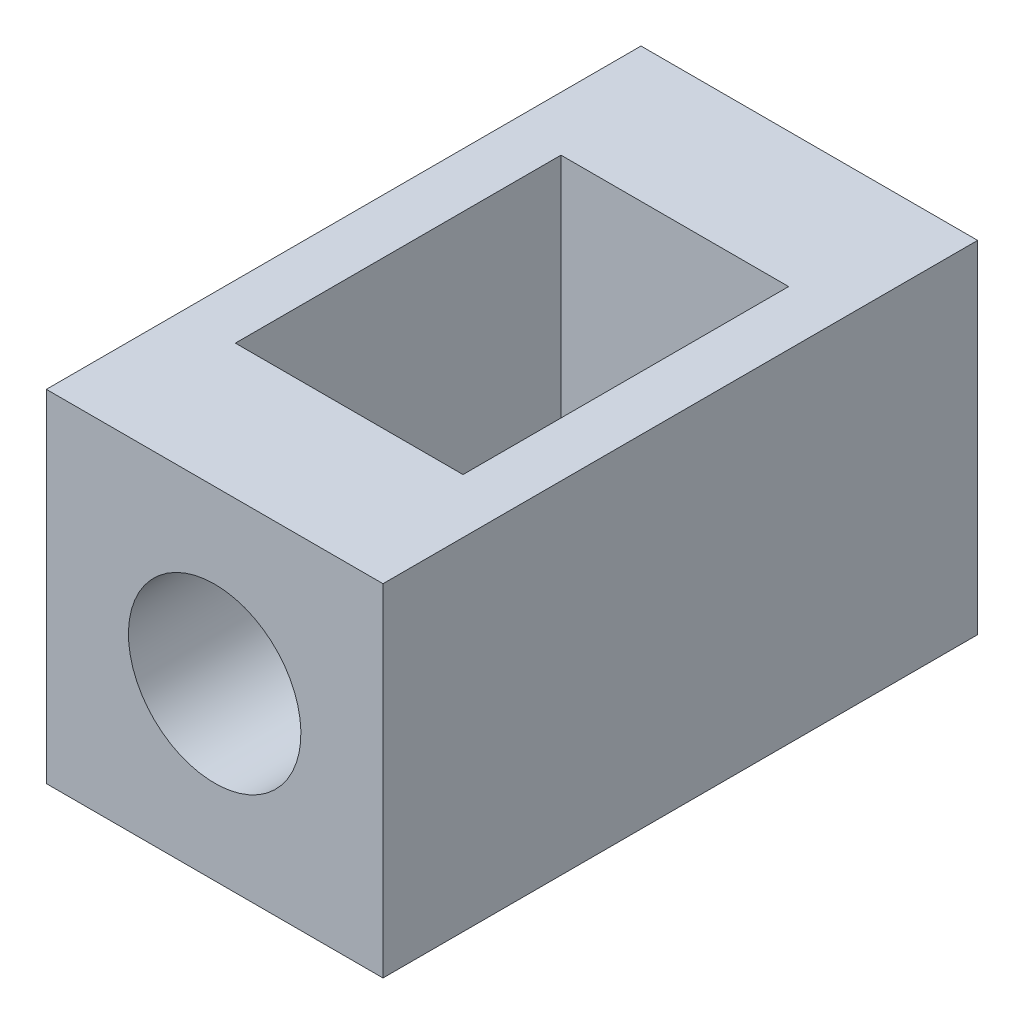
ISO-10303-21;
HEADER;
FILE_DESCRIPTION(('STEP AP214'),'2;1');
FILE_NAME('part.step','',(''),(''),'','','');
FILE_SCHEMA(('AUTOMOTIVE_DESIGN { 1 0 10303 214 1 1 1 1 }'));
ENDSEC;
DATA;
#1=APPLICATION_CONTEXT('core data for automotive mechanical design processes');
#2=APPLICATION_PROTOCOL_DEFINITION('international standard','automotive_design',2000,#1);
#3=PRODUCT_CONTEXT('',#1,'mechanical');
#4=PRODUCT('Part','Part','',(#3));
#5=PRODUCT_RELATED_PRODUCT_CATEGORY('part','',(#4));
#6=PRODUCT_DEFINITION_FORMATION('','',#4);
#7=PRODUCT_DEFINITION_CONTEXT('part definition',#1,'design');
#8=PRODUCT_DEFINITION('design','',#6,#7);
#9=PRODUCT_DEFINITION_SHAPE('','',#8);
#10=(LENGTH_UNIT() NAMED_UNIT(*) SI_UNIT(.MILLI.,.METRE.));
#11=(NAMED_UNIT(*) PLANE_ANGLE_UNIT() SI_UNIT($,.RADIAN.));
#12=(NAMED_UNIT(*) SI_UNIT($,.STERADIAN.) SOLID_ANGLE_UNIT());
#13=UNCERTAINTY_MEASURE_WITH_UNIT(LENGTH_MEASURE(1.E-05),#10,'distance_accuracy_value','');
#14=(GEOMETRIC_REPRESENTATION_CONTEXT(3) GLOBAL_UNCERTAINTY_ASSIGNED_CONTEXT((#13)) GLOBAL_UNIT_ASSIGNED_CONTEXT((#10,
#11,#12)) REPRESENTATION_CONTEXT('',''));
#15=CARTESIAN_POINT('',(0.,0.,0.));
#16=DIRECTION('',(0.,0.,1.));
#17=DIRECTION('',(1.,0.,0.));
#18=AXIS2_PLACEMENT_3D('',#15,#16,#17);
#19=CARTESIAN_POINT('',(15.2521980967912,-23.3190409170735,14.4950000000005));
#20=DIRECTION('',(0.,0.,1.));
#21=DIRECTION('',(3.01991605000675E-07,0.999999999999954,0.));
#22=AXIS2_PLACEMENT_3D('',#19,#20,#21);
#23=CYLINDRICAL_SURFACE('',#22,1.25);
#24=CARTESIAN_POINT('',(15.2521980967912,-23.3190409170728,12.5450000000005));
#25=DIRECTION('',(0.,0.,1.));
#26=DIRECTION('',(3.01991605000675E-07,0.999999999999954,0.));
#27=AXIS2_PLACEMENT_3D('',#24,#25,#26);
#28=CIRCLE('',#27,1.25);
#29=CARTESIAN_POINT('',(15.2521984742807,-22.0690409170728,12.5450000000005));
#30=VERTEX_POINT('',#29);
#31=EDGE_CURVE('E20',#30,#30,#28,.T.);
#32=ORIENTED_EDGE('',*,*,#31,.F.);
#33=EDGE_LOOP('',(#32));
#34=FACE_BOUND('',#33,.T.);
#35=CARTESIAN_POINT('',(15.2521980967912,-23.3190409170735,14.4950000000005));
#36=DIRECTION('',(0.,0.,1.));
#37=DIRECTION('',(3.01991605000675E-07,0.999999999999954,0.));
#38=AXIS2_PLACEMENT_3D('',#35,#36,#37);
#39=CIRCLE('',#38,1.25);
#40=CARTESIAN_POINT('',(15.2521984742807,-22.0690409170736,14.4950000000005));
#41=VERTEX_POINT('',#40);
#42=EDGE_CURVE('E11',#41,#41,#39,.T.);
#43=ORIENTED_EDGE('',*,*,#42,.T.);
#44=EDGE_LOOP('',(#43));
#45=FACE_BOUND('',#44,.T.);
#46=ADVANCED_FACE('F17',(#34,#45),#23,.F.);
#47=CARTESIAN_POINT('',(17.6921973493622,-25.7940416539324,14.4950000000006));
#48=DIRECTION('',(-0.999999999999954,3.01991605000676E-07,0.));
#49=DIRECTION('',(3.01991605000675E-07,0.999999999999954,0.));
#50=AXIS2_PLACEMENT_3D('',#47,#48,#49);
#51=PLANE('',#50);
#52=DIRECTION('',(0.,0.,1.));
#53=VECTOR('',#52,1.);
#54=CARTESIAN_POINT('',(17.6921988442212,-20.8440416539325,14.4950000000005));
#55=LINE('',#54,#53);
#56=CARTESIAN_POINT('',(17.6921988442212,-20.8440416539328,5.87500000000056));
#57=VERTEX_POINT('',#56);
#58=CARTESIAN_POINT('',(17.6921988442212,-20.8440416539325,14.4950000000005));
#59=VERTEX_POINT('',#58);
#60=EDGE_CURVE('E171',#57,#59,#55,.T.);
#61=ORIENTED_EDGE('',*,*,#60,.T.);
#62=DIRECTION('',(3.01991605000675E-07,0.999999999999954,0.));
#63=VECTOR('',#62,1.);
#64=CARTESIAN_POINT('',(17.6921973493622,-25.7940416539324,14.4950000000006));
#65=LINE('',#64,#63);
#66=CARTESIAN_POINT('',(17.6921973493622,-25.7940416539324,14.4950000000006));
#67=VERTEX_POINT('',#66);
#68=EDGE_CURVE('E27',#67,#59,#65,.T.);
#69=ORIENTED_EDGE('',*,*,#68,.F.);
#70=DIRECTION('',(0.,0.,1.));
#71=VECTOR('',#70,1.);
#72=CARTESIAN_POINT('',(17.6921973493622,-25.7940416539324,14.4950000000006));
#73=LINE('',#72,#71);
#74=CARTESIAN_POINT('',(17.6921973493622,-25.7940416539324,5.87500000000053));
#75=VERTEX_POINT('',#74);
#76=EDGE_CURVE('E224',#75,#67,#73,.T.);
#77=ORIENTED_EDGE('',*,*,#76,.F.);
#78=DIRECTION('',(3.01991605000675E-07,0.999999999999954,0.));
#79=VECTOR('',#78,1.);
#80=CARTESIAN_POINT('',(17.6921973493622,-25.7940416539324,5.87500000000053));
#81=LINE('',#80,#79);
#82=EDGE_CURVE('E73',#75,#57,#81,.T.);
#83=ORIENTED_EDGE('',*,*,#82,.T.);
#84=EDGE_LOOP('',(#61,#69,#77,#83));
#85=FACE_BOUND('',#84,.T.);
#86=ADVANCED_FACE('F282',(#85),#51,.F.);
#87=CARTESIAN_POINT('',(12.8121973493622,-25.7940401802134,14.4950000000005));
#88=DIRECTION('',(0.,0.,-1.));
#89=DIRECTION('',(0.999999999999954,-3.01991605000676E-07,0.));
#90=AXIS2_PLACEMENT_3D('',#87,#88,#89);
#91=PLANE('',#90);
#92=ORIENTED_EDGE('',*,*,#42,.F.);
#93=EDGE_LOOP('',(#92));
#94=FACE_BOUND('',#93,.T.);
#95=DIRECTION('',(-0.999999999999954,3.01991605000676E-07,0.));
#96=VECTOR('',#95,1.);
#97=CARTESIAN_POINT('',(12.8121988442212,-20.8440401802135,14.4950000000005));
#98=LINE('',#97,#96);
#99=CARTESIAN_POINT('',(12.8121988442212,-20.8440401802135,14.4950000000005));
#100=VERTEX_POINT('',#99);
#101=EDGE_CURVE('E208',#59,#100,#98,.T.);
#102=ORIENTED_EDGE('',*,*,#101,.T.);
#103=DIRECTION('',(3.01991605000675E-07,0.999999999999954,0.));
#104=VECTOR('',#103,1.);
#105=CARTESIAN_POINT('',(12.8121973493622,-25.7940401802134,14.4950000000005));
#106=LINE('',#105,#104);
#107=CARTESIAN_POINT('',(12.8121973493622,-25.7940401802134,14.4950000000005));
#108=VERTEX_POINT('',#107);
#109=EDGE_CURVE('E213',#108,#100,#106,.T.);
#110=ORIENTED_EDGE('',*,*,#109,.F.);
#111=DIRECTION('',(-0.999999999999954,3.01991605000676E-07,0.));
#112=VECTOR('',#111,1.);
#113=CARTESIAN_POINT('',(12.8121973493622,-25.7940401802134,14.4950000000005));
#114=LINE('',#113,#112);
#115=EDGE_CURVE('E219',#67,#108,#114,.T.);
#116=ORIENTED_EDGE('',*,*,#115,.F.);
#117=ORIENTED_EDGE('',*,*,#68,.T.);
#118=EDGE_LOOP('',(#102,#110,#116,#117));
#119=FACE_BOUND('',#118,.T.);
#120=ADVANCED_FACE('F285',(#94,#119),#91,.F.);
#121=CARTESIAN_POINT('',(12.8121973493622,-25.7940401802134,14.4950000000005));
#122=DIRECTION('',(0.999999999999954,-3.01991605000676E-07,0.));
#123=DIRECTION('',(-3.01991605000675E-07,-0.999999999999954,0.));
#124=AXIS2_PLACEMENT_3D('',#121,#122,#123);
#125=PLANE('',#124);
#126=DIRECTION('',(0.,0.,-1.));
#127=VECTOR('',#126,1.);
#128=CARTESIAN_POINT('',(12.8121988442212,-20.8440401802135,14.4950000000005));
#129=LINE('',#128,#127);
#130=CARTESIAN_POINT('',(12.8121988442212,-20.8440401802137,5.8750000000005));
#131=VERTEX_POINT('',#130);
#132=EDGE_CURVE('E196',#100,#131,#129,.T.);
#133=ORIENTED_EDGE('',*,*,#132,.T.);
#134=DIRECTION('',(3.01991605000675E-07,0.999999999999954,0.));
#135=VECTOR('',#134,1.);
#136=CARTESIAN_POINT('',(12.8121973493622,-25.7940401802132,5.87500000000047));
#137=LINE('',#136,#135);
#138=CARTESIAN_POINT('',(12.8121973493622,-25.7940401802132,5.87500000000047));
#139=VERTEX_POINT('',#138);
#140=EDGE_CURVE('E39',#139,#131,#137,.T.);
#141=ORIENTED_EDGE('',*,*,#140,.F.);
#142=DIRECTION('',(0.,0.,-1.));
#143=VECTOR('',#142,1.);
#144=CARTESIAN_POINT('',(12.8121973493622,-25.7940401802134,14.4950000000005));
#145=LINE('',#144,#143);
#146=EDGE_CURVE('E203',#108,#139,#145,.T.);
#147=ORIENTED_EDGE('',*,*,#146,.F.);
#148=ORIENTED_EDGE('',*,*,#109,.T.);
#149=EDGE_LOOP('',(#133,#141,#147,#148));
#150=FACE_BOUND('',#149,.T.);
#151=ADVANCED_FACE('F287',(#150),#125,.F.);
#152=CARTESIAN_POINT('',(12.8121973493622,-25.7940401802132,5.87500000000047));
#153=DIRECTION('',(0.,0.,1.));
#154=DIRECTION('',(-0.999999999999954,3.01991605000676E-07,0.));
#155=AXIS2_PLACEMENT_3D('',#152,#153,#154);
#156=PLANE('',#155);
#157=DIRECTION('',(0.999999999999954,-3.01991605000676E-07,0.));
#158=VECTOR('',#157,1.);
#159=CARTESIAN_POINT('',(12.8121988442212,-20.8440401802137,5.8750000000005));
#160=LINE('',#159,#158);
#161=EDGE_CURVE('E193',#131,#57,#160,.T.);
#162=ORIENTED_EDGE('',*,*,#161,.T.);
#163=ORIENTED_EDGE('',*,*,#82,.F.);
#164=DIRECTION('',(0.999999999999954,-3.01991605000676E-07,0.));
#165=VECTOR('',#164,1.);
#166=CARTESIAN_POINT('',(12.8121973493622,-25.7940401802132,5.87500000000047));
#167=LINE('',#166,#165);
#168=EDGE_CURVE('E199',#139,#75,#167,.T.);
#169=ORIENTED_EDGE('',*,*,#168,.F.);
#170=ORIENTED_EDGE('',*,*,#140,.T.);
#171=EDGE_LOOP('',(#162,#163,#169,#170));
#172=FACE_BOUND('',#171,.T.);
#173=ADVANCED_FACE('F303',(#172),#156,.F.);
#174=CARTESIAN_POINT('',(15.2521973493622,-25.7940409170728,10.1850000000005));
#175=DIRECTION('',(-3.01991605000675E-07,-0.999999999999954,0.));
#176=DIRECTION('',(-0.999999999999954,3.01991605000676E-07,0.));
#177=AXIS2_PLACEMENT_3D('',#174,#175,#176);
#178=PLANE('',#177);
#179=DIRECTION('',(0.,0.,1.));
#180=VECTOR('',#179,1.);
#181=CARTESIAN_POINT('',(16.9021973493622,-25.7940414153591,10.1850000000005));
#182=LINE('',#181,#180);
#183=CARTESIAN_POINT('',(16.9021973493622,-25.7940414153591,7.82500000000052));
#184=VERTEX_POINT('',#183);
#185=CARTESIAN_POINT('',(16.9021973493622,-25.7940414153591,12.5450000000005));
#186=VERTEX_POINT('',#185);
#187=EDGE_CURVE('E166',#184,#186,#182,.T.);
#188=ORIENTED_EDGE('',*,*,#187,.F.);
#189=DIRECTION('',(0.999999999999954,-3.01991605000676E-07,0.));
#190=VECTOR('',#189,1.);
#191=CARTESIAN_POINT('',(15.2521973493622,-25.7940409170728,7.8250000000005));
#192=LINE('',#191,#190);
#193=CARTESIAN_POINT('',(13.6021973493622,-25.7940404187868,7.82500000000048));
#194=VERTEX_POINT('',#193);
#195=EDGE_CURVE('E127',#194,#184,#192,.T.);
#196=ORIENTED_EDGE('',*,*,#195,.F.);
#197=DIRECTION('',(0.,0.,-1.));
#198=VECTOR('',#197,1.);
#199=CARTESIAN_POINT('',(13.6021973493622,-25.7940404187868,10.1850000000005));
#200=LINE('',#199,#198);
#201=CARTESIAN_POINT('',(13.6021973493622,-25.7940404187868,12.5450000000005));
#202=VERTEX_POINT('',#201);
#203=EDGE_CURVE('E151',#202,#194,#200,.T.);
#204=ORIENTED_EDGE('',*,*,#203,.F.);
#205=DIRECTION('',(-0.999999999999954,3.01991605000676E-07,0.));
#206=VECTOR('',#205,1.);
#207=CARTESIAN_POINT('',(15.2521973493622,-25.7940409170729,12.5450000000005));
#208=LINE('',#207,#206);
#209=EDGE_CURVE('E140',#186,#202,#208,.T.);
#210=ORIENTED_EDGE('',*,*,#209,.F.);
#211=EDGE_LOOP('',(#188,#196,#204,#210));
#212=FACE_BOUND('',#211,.T.);
#213=ORIENTED_EDGE('',*,*,#76,.T.);
#214=ORIENTED_EDGE('',*,*,#115,.T.);
#215=ORIENTED_EDGE('',*,*,#146,.T.);
#216=ORIENTED_EDGE('',*,*,#168,.T.);
#217=EDGE_LOOP('',(#213,#214,#215,#216));
#218=FACE_BOUND('',#217,.T.);
#219=ADVANCED_FACE('F293',(#212,#218),#178,.T.);
#220=CARTESIAN_POINT('',(15.2521988442212,-20.8440409170737,10.1850000000005));
#221=DIRECTION('',(-3.01991605000675E-07,-0.999999999999954,0.));
#222=DIRECTION('',(-0.999999999999954,3.01991605000676E-07,0.));
#223=AXIS2_PLACEMENT_3D('',#220,#221,#222);
#224=PLANE('',#223);
#225=DIRECTION('',(0.999999999999954,-3.01991605000676E-07,0.));
#226=VECTOR('',#225,1.);
#227=CARTESIAN_POINT('',(13.6021988442212,-20.8440404187866,7.82500000000051));
#228=LINE('',#227,#226);
#229=CARTESIAN_POINT('',(13.6021988442212,-20.8440404187866,7.82500000000051));
#230=VERTEX_POINT('',#229);
#231=CARTESIAN_POINT('',(16.9021988442202,-20.8440414153595,7.82500000000055));
#232=VERTEX_POINT('',#231);
#233=EDGE_CURVE('E161',#230,#232,#228,.T.);
#234=ORIENTED_EDGE('',*,*,#233,.T.);
#235=DIRECTION('',(0.,0.,1.));
#236=VECTOR('',#235,1.);
#237=CARTESIAN_POINT('',(16.9021988442202,-20.8440414153598,12.5450000000005));
#238=LINE('',#237,#236);
#239=CARTESIAN_POINT('',(16.9021988442202,-20.8440414153598,12.5450000000005));
#240=VERTEX_POINT('',#239);
#241=EDGE_CURVE('E84',#232,#240,#238,.T.);
#242=ORIENTED_EDGE('',*,*,#241,.T.);
#243=DIRECTION('',(-0.999999999999954,3.01991605000676E-07,0.));
#244=VECTOR('',#243,1.);
#245=CARTESIAN_POINT('',(13.6021988442212,-20.8440404187868,12.5450000000005));
#246=LINE('',#245,#244);
#247=CARTESIAN_POINT('',(13.6021988442212,-20.8440404187868,12.5450000000005));
#248=VERTEX_POINT('',#247);
#249=EDGE_CURVE('E130',#240,#248,#246,.T.);
#250=ORIENTED_EDGE('',*,*,#249,.T.);
#251=DIRECTION('',(0.,0.,-1.));
#252=VECTOR('',#251,1.);
#253=CARTESIAN_POINT('',(13.6021988442212,-20.8440404187868,12.5450000000005));
#254=LINE('',#253,#252);
#255=EDGE_CURVE('E116',#248,#230,#254,.T.);
#256=ORIENTED_EDGE('',*,*,#255,.T.);
#257=EDGE_LOOP('',(#234,#242,#250,#256));
#258=FACE_BOUND('',#257,.T.);
#259=ORIENTED_EDGE('',*,*,#60,.F.);
#260=ORIENTED_EDGE('',*,*,#161,.F.);
#261=ORIENTED_EDGE('',*,*,#132,.F.);
#262=ORIENTED_EDGE('',*,*,#101,.F.);
#263=EDGE_LOOP('',(#259,#260,#261,#262));
#264=FACE_BOUND('',#263,.T.);
#265=ADVANCED_FACE('F131',(#258,#264),#224,.F.);
#266=CARTESIAN_POINT('',(16.9021988442202,-20.8440414153598,12.5450000000005));
#267=DIRECTION('',(0.999999999999954,-3.01991605000676E-07,0.));
#268=DIRECTION('',(-3.01991605000675E-07,-0.999999999999954,0.));
#269=AXIS2_PLACEMENT_3D('',#266,#267,#268);
#270=PLANE('',#269);
#271=ORIENTED_EDGE('',*,*,#187,.T.);
#272=DIRECTION('',(-3.01991605000675E-07,-0.999999999999954,0.));
#273=VECTOR('',#272,1.);
#274=CARTESIAN_POINT('',(16.9021988442202,-20.8440414153598,12.5450000000005));
#275=LINE('',#274,#273);
#276=EDGE_CURVE('E136',#240,#186,#275,.T.);
#277=ORIENTED_EDGE('',*,*,#276,.F.);
#278=ORIENTED_EDGE('',*,*,#241,.F.);
#279=DIRECTION('',(-3.01991605000675E-07,-0.999999999999954,0.));
#280=VECTOR('',#279,1.);
#281=CARTESIAN_POINT('',(16.9021988442202,-20.8440414153595,7.82500000000055));
#282=LINE('',#281,#280);
#283=EDGE_CURVE('E158',#232,#184,#282,.T.);
#284=ORIENTED_EDGE('',*,*,#283,.T.);
#285=EDGE_LOOP('',(#271,#277,#278,#284));
#286=FACE_BOUND('',#285,.T.);
#287=ADVANCED_FACE('F312',(#286),#270,.F.);
#288=CARTESIAN_POINT('',(13.6021988442212,-20.8440404187866,7.82500000000051));
#289=DIRECTION('',(0.,0.,-1.));
#290=DIRECTION('',(-3.01991605000675E-07,-0.999999999999954,0.));
#291=AXIS2_PLACEMENT_3D('',#288,#289,#290);
#292=PLANE('',#291);
#293=ORIENTED_EDGE('',*,*,#195,.T.);
#294=ORIENTED_EDGE('',*,*,#283,.F.);
#295=ORIENTED_EDGE('',*,*,#233,.F.);
#296=DIRECTION('',(-3.01991605000675E-07,-0.999999999999954,0.));
#297=VECTOR('',#296,1.);
#298=CARTESIAN_POINT('',(13.6021988442212,-20.8440404187866,7.82500000000051));
#299=LINE('',#298,#297);
#300=EDGE_CURVE('E124',#230,#194,#299,.T.);
#301=ORIENTED_EDGE('',*,*,#300,.T.);
#302=EDGE_LOOP('',(#293,#294,#295,#301));
#303=FACE_BOUND('',#302,.T.);
#304=ADVANCED_FACE('F315',(#303),#292,.F.);
#305=CARTESIAN_POINT('',(13.6021988442212,-20.8440404187868,12.5450000000005));
#306=DIRECTION('',(-0.999999999999954,3.01991605000676E-07,0.));
#307=DIRECTION('',(3.01991605000675E-07,0.999999999999954,0.));
#308=AXIS2_PLACEMENT_3D('',#305,#306,#307);
#309=PLANE('',#308);
#310=ORIENTED_EDGE('',*,*,#203,.T.);
#311=ORIENTED_EDGE('',*,*,#300,.F.);
#312=ORIENTED_EDGE('',*,*,#255,.F.);
#313=DIRECTION('',(-3.01991605000675E-07,-0.999999999999954,0.));
#314=VECTOR('',#313,1.);
#315=CARTESIAN_POINT('',(13.6021988442212,-20.8440404187868,12.5450000000005));
#316=LINE('',#315,#314);
#317=EDGE_CURVE('E121',#248,#202,#316,.T.);
#318=ORIENTED_EDGE('',*,*,#317,.T.);
#319=EDGE_LOOP('',(#310,#311,#312,#318));
#320=FACE_BOUND('',#319,.T.);
#321=ADVANCED_FACE('F119',(#320),#309,.F.);
#322=CARTESIAN_POINT('',(13.6021988442212,-20.8440404187868,12.5450000000005));
#323=DIRECTION('',(0.,0.,1.));
#324=DIRECTION('',(3.01991605000675E-07,0.999999999999954,0.));
#325=AXIS2_PLACEMENT_3D('',#322,#323,#324);
#326=PLANE('',#325);
#327=ORIENTED_EDGE('',*,*,#31,.T.);
#328=EDGE_LOOP('',(#327));
#329=FACE_BOUND('',#328,.T.);
#330=ORIENTED_EDGE('',*,*,#209,.T.);
#331=ORIENTED_EDGE('',*,*,#317,.F.);
#332=ORIENTED_EDGE('',*,*,#249,.F.);
#333=ORIENTED_EDGE('',*,*,#276,.T.);
#334=EDGE_LOOP('',(#330,#331,#332,#333));
#335=FACE_BOUND('',#334,.T.);
#336=ADVANCED_FACE('F138',(#329,#335),#326,.F.);
#337=CLOSED_SHELL('',(#46,#86,#120,#151,#173,#219,#265,#287,#304,#321,#336));
#338=MANIFOLD_SOLID_BREP('B1',#337);
#339=ADVANCED_BREP_SHAPE_REPRESENTATION('',(#18,#338),#14);
#340=SHAPE_DEFINITION_REPRESENTATION(#9,#339);
ENDSEC;
END-ISO-10303-21;
